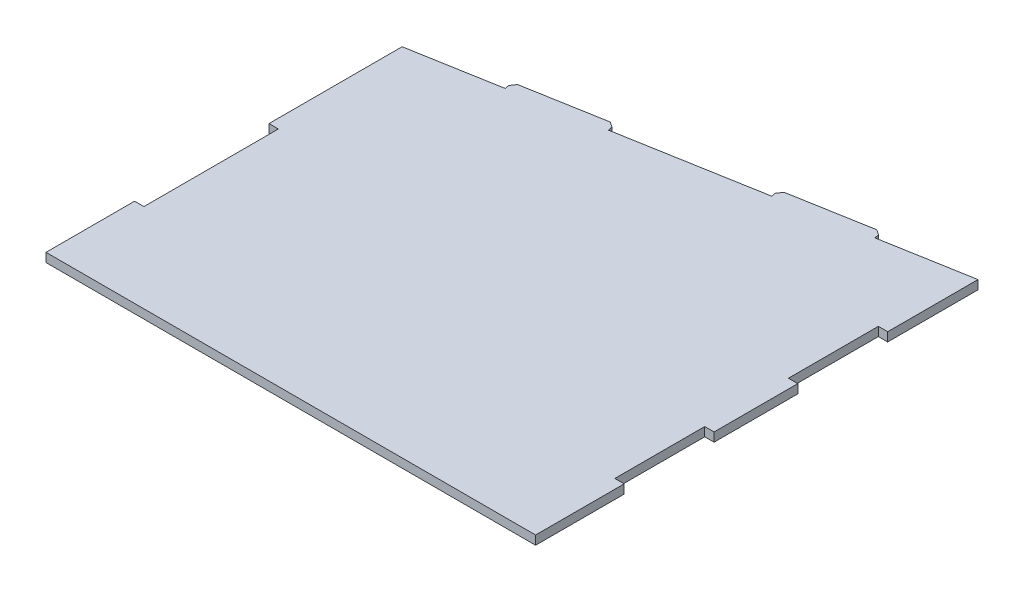
ISO-10303-21;
HEADER;
FILE_DESCRIPTION(('STEP AP214'),'2;1');
FILE_NAME('part.step','',(''),(''),'','','');
FILE_SCHEMA(('AUTOMOTIVE_DESIGN { 1 0 10303 214 1 1 1 1 }'));
ENDSEC;
DATA;
#1=APPLICATION_CONTEXT('core data for automotive mechanical design processes');
#2=APPLICATION_PROTOCOL_DEFINITION('international standard','automotive_design',2000,#1);
#3=PRODUCT_CONTEXT('',#1,'mechanical');
#4=PRODUCT('Part','Part','',(#3));
#5=PRODUCT_RELATED_PRODUCT_CATEGORY('part','',(#4));
#6=PRODUCT_DEFINITION_FORMATION('','',#4);
#7=PRODUCT_DEFINITION_CONTEXT('part definition',#1,'design');
#8=PRODUCT_DEFINITION('design','',#6,#7);
#9=PRODUCT_DEFINITION_SHAPE('','',#8);
#10=(LENGTH_UNIT() NAMED_UNIT(*) SI_UNIT(.MILLI.,.METRE.));
#11=(NAMED_UNIT(*) PLANE_ANGLE_UNIT() SI_UNIT($,.RADIAN.));
#12=(NAMED_UNIT(*) SI_UNIT($,.STERADIAN.) SOLID_ANGLE_UNIT());
#13=UNCERTAINTY_MEASURE_WITH_UNIT(LENGTH_MEASURE(1.E-05),#10,'distance_accuracy_value','');
#14=(GEOMETRIC_REPRESENTATION_CONTEXT(3) GLOBAL_UNCERTAINTY_ASSIGNED_CONTEXT((#13)) GLOBAL_UNIT_ASSIGNED_CONTEXT((#10,
#11,#12)) REPRESENTATION_CONTEXT('',''));
#15=CARTESIAN_POINT('',(0.,0.,0.));
#16=DIRECTION('',(0.,0.,1.));
#17=DIRECTION('',(1.,0.,0.));
#18=AXIS2_PLACEMENT_3D('',#15,#16,#17);
#19=CARTESIAN_POINT('',(-55.,-2.,9.69798393896559));
#20=DIRECTION('',(-0.173648177666931,0.,-0.984807753012208));
#21=DIRECTION('',(-0.984807753012208,0.,0.173648177666931));
#22=AXIS2_PLACEMENT_3D('',#19,#20,#21);
#23=PLANE('',#22);
#24=DIRECTION('',(-0.984807753012208,0.,0.173648177666931));
#25=VECTOR('',#24,1.);
#26=CARTESIAN_POINT('',(-55.,0.,9.69798393896559));
#27=LINE('',#26,#25);
#28=CARTESIAN_POINT('',(15.6076898795117,0.,-2.75205683228837));
#29=VERTEX_POINT('',#28);
#30=CARTESIAN_POINT('',(-15.6076898795117,0.,2.75205683228836));
#31=VERTEX_POINT('',#30);
#32=EDGE_CURVE('E91',#29,#31,#27,.T.);
#33=ORIENTED_EDGE('',*,*,#32,.F.);
#34=CARTESIAN_POINT('',(15.6076898795117,0.,-2.75205683228837));
#35=CARTESIAN_POINT('',(15.6076898795117,-2.,-2.75205683228837));
#36=B_SPLINE_CURVE_WITH_KNOTS('',1,(#34,#35),.UNSPECIFIED.,.F.,.F.,(2,2),(0.,
0.0454545454545455),.UNSPECIFIED.);
#37=CARTESIAN_POINT('',(15.6076898795117,-2.,-2.75205683228837));
#38=VERTEX_POINT('',#37);
#39=EDGE_CURVE('E258',#29,#38,#36,.T.);
#40=ORIENTED_EDGE('',*,*,#39,.T.);
#41=DIRECTION('',(-0.984807753012208,0.,0.173648177666931));
#42=VECTOR('',#41,1.);
#43=CARTESIAN_POINT('',(-55.,-2.,9.69798393896559));
#44=LINE('',#43,#42);
#45=CARTESIAN_POINT('',(-15.6076898795117,-2.,2.75205683228836));
#46=VERTEX_POINT('',#45);
#47=EDGE_CURVE('E269',#38,#46,#44,.T.);
#48=ORIENTED_EDGE('',*,*,#47,.T.);
#49=CARTESIAN_POINT('',(-15.6076898795117,-2.,2.75205683228836));
#50=CARTESIAN_POINT('',(-15.6076898795117,0.,2.75205683228836));
#51=B_SPLINE_CURVE_WITH_KNOTS('',1,(#49,#50),.UNSPECIFIED.,.F.,.F.,(2,2),(0.5,
0.545454545454545),.UNSPECIFIED.);
#52=EDGE_CURVE('E478',#46,#31,#51,.T.);
#53=ORIENTED_EDGE('',*,*,#52,.T.);
#54=EDGE_LOOP('',(#33,#40,#48,#53));
#55=FACE_BOUND('',#54,.T.);
#56=ADVANCED_FACE('F68',(#55),#23,.T.);
#57=CARTESIAN_POINT('',(55.,-2.,-9.6979839389656));
#58=VERTEX_POINT('',#57);
#59=CARTESIAN_POINT('',(35.3038449397558,-2.,-6.22502038562699));
#60=VERTEX_POINT('',#59);
#61=EDGE_CURVE('E277',#58,#60,#44,.T.);
#62=ORIENTED_EDGE('',*,*,#61,.T.);
#63=CARTESIAN_POINT('',(35.3038449397558,-2.,-6.22502038562699));
#64=CARTESIAN_POINT('',(35.3038449397558,0.,-6.22502038562699));
#65=B_SPLINE_CURVE_WITH_KNOTS('',1,(#63,#64),.UNSPECIFIED.,.F.,.F.,(2,2),(0.5,
0.545454545454545),.UNSPECIFIED.);
#66=CARTESIAN_POINT('',(35.3038449397558,0.,-6.22502038562698));
#67=VERTEX_POINT('',#66);
#68=EDGE_CURVE('E265',#60,#67,#65,.T.);
#69=ORIENTED_EDGE('',*,*,#68,.T.);
#70=CARTESIAN_POINT('',(55.,0.,-9.6979839389656));
#71=VERTEX_POINT('',#70);
#72=EDGE_CURVE('E299',#71,#67,#27,.T.);
#73=ORIENTED_EDGE('',*,*,#72,.F.);
#74=DIRECTION('',(0.,1.,0.));
#75=VECTOR('',#74,1.);
#76=CARTESIAN_POINT('',(55.,-2.,-9.6979839389656));
#77=LINE('',#76,#75);
#78=EDGE_CURVE('E292',#58,#71,#77,.T.);
#79=ORIENTED_EDGE('',*,*,#78,.F.);
#80=EDGE_LOOP('',(#62,#69,#73,#79));
#81=FACE_BOUND('',#80,.T.);
#82=ADVANCED_FACE('F553',(#81),#23,.T.);
#83=CARTESIAN_POINT('',(-35.3038449397558,0.,6.22502038562697));
#84=VERTEX_POINT('',#83);
#85=CARTESIAN_POINT('',(-55.,0.,9.69798393896559));
#86=VERTEX_POINT('',#85);
#87=EDGE_CURVE('E296',#84,#86,#27,.T.);
#88=ORIENTED_EDGE('',*,*,#87,.F.);
#89=CARTESIAN_POINT('',(-35.3038449397558,0.,6.22502038562697));
#90=CARTESIAN_POINT('',(-35.3038449397558,-2.,6.22502038562697));
#91=B_SPLINE_CURVE_WITH_KNOTS('',1,(#89,#90),.UNSPECIFIED.,.F.,.F.,(2,2),(0.,
0.0454545454545455),.UNSPECIFIED.);
#92=CARTESIAN_POINT('',(-35.3038449397558,-2.,6.22502038562697));
#93=VERTEX_POINT('',#92);
#94=EDGE_CURVE('E487',#84,#93,#91,.T.);
#95=ORIENTED_EDGE('',*,*,#94,.T.);
#96=CARTESIAN_POINT('',(-55.,-2.,9.69798393896559));
#97=VERTEX_POINT('',#96);
#98=EDGE_CURVE('E278',#93,#97,#44,.T.);
#99=ORIENTED_EDGE('',*,*,#98,.T.);
#100=DIRECTION('',(0.,1.,0.));
#101=VECTOR('',#100,1.);
#102=CARTESIAN_POINT('',(-55.,-2.,9.69798393896559));
#103=LINE('',#102,#101);
#104=EDGE_CURVE('E316',#97,#86,#103,.T.);
#105=ORIENTED_EDGE('',*,*,#104,.T.);
#106=EDGE_LOOP('',(#88,#95,#99,#105));
#107=FACE_BOUND('',#106,.T.);
#108=ADVANCED_FACE('F592',(#107),#23,.T.);
#109=CARTESIAN_POINT('',(55.,-2.,89.6979839389656));
#110=DIRECTION('',(1.,0.,0.));
#111=DIRECTION('',(0.,0.,-1.));
#112=AXIS2_PLACEMENT_3D('',#109,#110,#111);
#113=PLANE('',#112);
#114=DIRECTION('',(0.,0.,-1.));
#115=VECTOR('',#114,1.);
#116=CARTESIAN_POINT('',(55.,-2.,89.6979839389656));
#117=LINE('',#116,#115);
#118=CARTESIAN_POINT('',(55.,-2.,89.6979839389656));
#119=VERTEX_POINT('',#118);
#120=CARTESIAN_POINT('',(55.,-1.99999999999999,69.7979839389656));
#121=VERTEX_POINT('',#120);
#122=EDGE_CURVE('E282',#119,#121,#117,.T.);
#123=ORIENTED_EDGE('',*,*,#122,.T.);
#124=DIRECTION('',(0.,1.,0.));
#125=VECTOR('',#124,1.);
#126=CARTESIAN_POINT('',(55.,-2.,69.7979839389656));
#127=LINE('',#126,#125);
#128=CARTESIAN_POINT('',(55.,0.,69.7979839389656));
#129=VERTEX_POINT('',#128);
#130=EDGE_CURVE('E384',#121,#129,#127,.T.);
#131=ORIENTED_EDGE('',*,*,#130,.T.);
#132=DIRECTION('',(0.,0.,-1.));
#133=VECTOR('',#132,1.);
#134=CARTESIAN_POINT('',(55.,0.,89.6979839389656));
#135=LINE('',#134,#133);
#136=CARTESIAN_POINT('',(55.,0.,89.6979839389656));
#137=VERTEX_POINT('',#136);
#138=EDGE_CURVE('E293',#137,#129,#135,.T.);
#139=ORIENTED_EDGE('',*,*,#138,.F.);
#140=DIRECTION('',(0.,1.,0.));
#141=VECTOR('',#140,1.);
#142=CARTESIAN_POINT('',(55.,-2.,89.6979839389656));
#143=LINE('',#142,#141);
#144=EDGE_CURVE('E310',#119,#137,#143,.T.);
#145=ORIENTED_EDGE('',*,*,#144,.F.);
#146=EDGE_LOOP('',(#123,#131,#139,#145));
#147=FACE_BOUND('',#146,.T.);
#148=ADVANCED_FACE('F70',(#147),#113,.T.);
#149=CARTESIAN_POINT('',(55.,0.,49.5979839389656));
#150=VERTEX_POINT('',#149);
#151=CARTESIAN_POINT('',(55.,0.,30.7979839389656));
#152=VERTEX_POINT('',#151);
#153=EDGE_CURVE('E297',#150,#152,#135,.T.);
#154=ORIENTED_EDGE('',*,*,#153,.F.);
#155=DIRECTION('',(0.,-1.,0.));
#156=VECTOR('',#155,1.);
#157=CARTESIAN_POINT('',(55.,-2.,49.5979839389656));
#158=LINE('',#157,#156);
#159=CARTESIAN_POINT('',(55.,-1.99999999999999,49.5979839389656));
#160=VERTEX_POINT('',#159);
#161=EDGE_CURVE('E340',#150,#160,#158,.T.);
#162=ORIENTED_EDGE('',*,*,#161,.T.);
#163=CARTESIAN_POINT('',(55.,-1.99999999999999,30.7979839389656));
#164=VERTEX_POINT('',#163);
#165=EDGE_CURVE('E339',#160,#164,#117,.T.);
#166=ORIENTED_EDGE('',*,*,#165,.T.);
#167=DIRECTION('',(0.,1.,0.));
#168=VECTOR('',#167,1.);
#169=CARTESIAN_POINT('',(55.,-2.,30.7979839389656));
#170=LINE('',#169,#168);
#171=EDGE_CURVE('E328',#164,#152,#170,.T.);
#172=ORIENTED_EDGE('',*,*,#171,.T.);
#173=EDGE_LOOP('',(#154,#162,#166,#172));
#174=FACE_BOUND('',#173,.T.);
#175=ADVANCED_FACE('F336',(#174),#113,.T.);
#176=CARTESIAN_POINT('',(55.,0.,10.5979839389656));
#177=VERTEX_POINT('',#176);
#178=EDGE_CURVE('E298',#177,#71,#135,.T.);
#179=ORIENTED_EDGE('',*,*,#178,.F.);
#180=DIRECTION('',(0.,-1.,0.));
#181=VECTOR('',#180,1.);
#182=CARTESIAN_POINT('',(55.,-2.,10.5979839389656));
#183=LINE('',#182,#181);
#184=CARTESIAN_POINT('',(55.,-1.99999999999999,10.5979839389656));
#185=VERTEX_POINT('',#184);
#186=EDGE_CURVE('E341',#177,#185,#183,.T.);
#187=ORIENTED_EDGE('',*,*,#186,.T.);
#188=EDGE_CURVE('E309',#185,#58,#117,.T.);
#189=ORIENTED_EDGE('',*,*,#188,.T.);
#190=ORIENTED_EDGE('',*,*,#78,.T.);
#191=EDGE_LOOP('',(#179,#187,#189,#190));
#192=FACE_BOUND('',#191,.T.);
#193=ADVANCED_FACE('F630',(#192),#113,.T.);
#194=CARTESIAN_POINT('',(0.,-2.,0.));
#195=DIRECTION('',(0.,-1.,0.));
#196=DIRECTION('',(0.,0.,-1.));
#197=AXIS2_PLACEMENT_3D('',#194,#195,#196);
#198=PLANE('',#197);
#199=CARTESIAN_POINT('',(52.9,-1.99999999999999,49.5979839389656));
#200=CARTESIAN_POINT('',(52.9,-1.99999999999999,69.7979839389656));
#201=B_SPLINE_CURVE_WITH_KNOTS('',1,(#199,#200),.UNSPECIFIED.,.F.,.F.,(2,2),(0.0491071428571429,
0.5),.UNSPECIFIED.);
#202=CARTESIAN_POINT('',(52.9,-1.99999999999999,49.5979839389656));
#203=VERTEX_POINT('',#202);
#204=CARTESIAN_POINT('',(52.9,-1.99999999999999,69.7979839389656));
#205=VERTEX_POINT('',#204);
#206=EDGE_CURVE('E436',#203,#205,#201,.T.);
#207=ORIENTED_EDGE('',*,*,#206,.T.);
#208=CARTESIAN_POINT('',(52.9,-1.99999999999999,69.7979839389656));
#209=CARTESIAN_POINT('',(55.1,-1.99999999999999,69.7979839389656));
#210=B_SPLINE_CURVE_WITH_KNOTS('',1,(#208,#209),.UNSPECIFIED.,.F.,.F.,(2,2),(0.5,
0.549107142857143),.UNSPECIFIED.);
#211=EDGE_CURVE('E431',#205,#121,#210,.T.);
#212=ORIENTED_EDGE('',*,*,#211,.T.);
#213=ORIENTED_EDGE('',*,*,#122,.F.);
#214=DIRECTION('',(1.,0.,0.));
#215=VECTOR('',#214,1.);
#216=CARTESIAN_POINT('',(-55.,-2.,89.6979839389656));
#217=LINE('',#216,#215);
#218=CARTESIAN_POINT('',(-55.,-2.,89.6979839389656));
#219=VERTEX_POINT('',#218);
#220=EDGE_CURVE('E289',#219,#119,#217,.T.);
#221=ORIENTED_EDGE('',*,*,#220,.F.);
#222=DIRECTION('',(0.,0.,1.));
#223=VECTOR('',#222,1.);
#224=CARTESIAN_POINT('',(-55.,-2.,89.6979839389656));
#225=LINE('',#224,#223);
#226=CARTESIAN_POINT('',(-55.,-2.00000000000004,69.7979839389653));
#227=VERTEX_POINT('',#226);
#228=EDGE_CURVE('E281',#227,#219,#225,.T.);
#229=ORIENTED_EDGE('',*,*,#228,.F.);
#230=CARTESIAN_POINT('',(-52.8999999999998,-2.00000000000004,69.7979839389653));
#231=CARTESIAN_POINT('',(-55.0999999999998,-2.00000000000004,69.7979839389653));
#232=B_SPLINE_CURVE_WITH_KNOTS('',1,(#230,#231),.UNSPECIFIED.,.F.,.F.,(2,2),(0.5,
0.533950617283951),.UNSPECIFIED.);
#233=CARTESIAN_POINT('',(-52.8999999999998,-2.00000000000004,69.7979839389653));
#234=VERTEX_POINT('',#233);
#235=EDGE_CURVE('E364',#234,#227,#232,.T.);
#236=ORIENTED_EDGE('',*,*,#235,.F.);
#237=CARTESIAN_POINT('',(-52.8999999999997,-2.00000000000003,39.5979839389653));
#238=CARTESIAN_POINT('',(-52.8999999999998,-2.00000000000004,69.7979839389653));
#239=B_SPLINE_CURVE_WITH_KNOTS('',1,(#237,#238),.UNSPECIFIED.,.F.,.F.,(2,2),(0.0339506172839506,
0.5),.UNSPECIFIED.);
#240=CARTESIAN_POINT('',(-52.8999999999997,-2.00000000000003,39.5979839389653));
#241=VERTEX_POINT('',#240);
#242=EDGE_CURVE('E369',#241,#234,#239,.T.);
#243=ORIENTED_EDGE('',*,*,#242,.F.);
#244=CARTESIAN_POINT('',(-55.0999999999997,-2.00000000000003,39.5979839389653));
#245=CARTESIAN_POINT('',(-52.8999999999997,-2.00000000000003,39.5979839389653));
#246=B_SPLINE_CURVE_WITH_KNOTS('',1,(#244,#245),.UNSPECIFIED.,.F.,.F.,(2,2),(0.,
0.0339506172839506),.UNSPECIFIED.);
#247=CARTESIAN_POINT('',(-55.,-2.00000000000003,39.5979839389653));
#248=VERTEX_POINT('',#247);
#249=EDGE_CURVE('E377',#248,#241,#246,.T.);
#250=ORIENTED_EDGE('',*,*,#249,.F.);
#251=EDGE_CURVE('E286',#97,#248,#225,.T.);
#252=ORIENTED_EDGE('',*,*,#251,.F.);
#253=ORIENTED_EDGE('',*,*,#98,.F.);
#254=DIRECTION('',(0.173648177666931,0.,0.984807753012208));
#255=VECTOR('',#254,1.);
#256=CARTESIAN_POINT('',(-35.9984376504235,-2.,2.28578937357821));
#257=LINE('',#256,#255);
#258=CARTESIAN_POINT('',(-35.4774931174228,-2.,5.24021263261482));
#259=VERTEX_POINT('',#258);
#260=EDGE_CURVE('E476',#259,#93,#257,.T.);
#261=ORIENTED_EDGE('',*,*,#260,.F.);
#262=DIRECTION('',(0.573576436351044,0.,-0.819152044288994));
#263=VECTOR('',#262,1.);
#264=CARTESIAN_POINT('',(-34.2607537544048,-2.,3.50252873659611));
#265=LINE('',#264,#263);
#266=CARTESIAN_POINT('',(-34.6663335420775,-2.,4.08175670193568));
#267=VERTEX_POINT('',#266);
#268=EDGE_CURVE('E464',#259,#267,#265,.T.);
#269=ORIENTED_EDGE('',*,*,#268,.T.);
#270=DIRECTION('',(-0.984807753012208,0.,0.173648177666931));
#271=VECTOR('',#270,1.);
#272=CARTESIAN_POINT('',(-35.6511412950897,-2.,4.25540487960261));
#273=LINE('',#272,#271);
#274=CARTESIAN_POINT('',(-16.9397939878577,-2.,0.956089503930917));
#275=VERTEX_POINT('',#274);
#276=EDGE_CURVE('E472',#275,#267,#273,.T.);
#277=ORIENTED_EDGE('',*,*,#276,.F.);
#278=DIRECTION('',(0.819152044288993,0.,0.573576436351045));
#279=VECTOR('',#278,1.);
#280=CARTESIAN_POINT('',(-29.1035812599887,-2.,-7.56108603719447));
#281=LINE('',#280,#279);
#282=CARTESIAN_POINT('',(-15.7813380571786,-2.,1.76724907927619));
#283=VERTEX_POINT('',#282);
#284=EDGE_CURVE('E462',#275,#283,#281,.T.);
#285=ORIENTED_EDGE('',*,*,#284,.T.);
#286=DIRECTION('',(0.173648177666931,0.,0.984807753012208));
#287=VECTOR('',#286,1.);
#288=CARTESIAN_POINT('',(-16.3022825901794,-2.,-1.1871741797604));
#289=LINE('',#288,#287);
#290=EDGE_CURVE('E275',#283,#46,#289,.T.);
#291=ORIENTED_EDGE('',*,*,#290,.T.);
#292=ORIENTED_EDGE('',*,*,#47,.F.);
#293=DIRECTION('',(0.173648177666931,0.,0.984807753012208));
#294=VECTOR('',#293,1.);
#295=CARTESIAN_POINT('',(14.913097168844,-2.,-6.69128784433718));
#296=LINE('',#295,#294);
#297=CARTESIAN_POINT('',(15.4340417018448,-2.,-3.73686458530055));
#298=VERTEX_POINT('',#297);
#299=EDGE_CURVE('E254',#298,#38,#296,.T.);
#300=ORIENTED_EDGE('',*,*,#299,.F.);
#301=DIRECTION('',(0.573576436351044,0.,-0.819152044288993));
#302=VECTOR('',#301,1.);
#303=CARTESIAN_POINT('',(16.6507810648627,-2.,-5.47454848131927));
#304=LINE('',#303,#302);
#305=CARTESIAN_POINT('',(16.24520127719,-2.,-4.89532051597969));
#306=VERTEX_POINT('',#305);
#307=EDGE_CURVE('E509',#298,#306,#304,.T.);
#308=ORIENTED_EDGE('',*,*,#307,.T.);
#309=DIRECTION('',(-0.984807753012208,0.,0.173648177666931));
#310=VECTOR('',#309,1.);
#311=CARTESIAN_POINT('',(15.2603935241778,-2.,-4.72167233831276));
#312=LINE('',#311,#310);
#313=CARTESIAN_POINT('',(33.9717408314098,-2.,-8.02098771398445));
#314=VERTEX_POINT('',#313);
#315=EDGE_CURVE('E517',#314,#306,#312,.T.);
#316=ORIENTED_EDGE('',*,*,#315,.F.);
#317=DIRECTION('',(0.819152044288991,0.,0.573576436351048));
#318=VECTOR('',#317,1.);
#319=CARTESIAN_POINT('',(21.8079535592789,-2.,-16.5381632551099));
#320=LINE('',#319,#318);
#321=CARTESIAN_POINT('',(35.1301967620889,-2.,-7.20982813863917));
#322=VERTEX_POINT('',#321);
#323=EDGE_CURVE('E507',#314,#322,#320,.T.);
#324=ORIENTED_EDGE('',*,*,#323,.T.);
#325=DIRECTION('',(0.173648177666931,0.,0.984807753012208));
#326=VECTOR('',#325,1.);
#327=CARTESIAN_POINT('',(34.6092522290881,-2.,-10.1642513976758));
#328=LINE('',#327,#326);
#329=EDGE_CURVE('E264',#322,#60,#328,.T.);
#330=ORIENTED_EDGE('',*,*,#329,.T.);
#331=ORIENTED_EDGE('',*,*,#61,.F.);
#332=ORIENTED_EDGE('',*,*,#188,.F.);
#333=CARTESIAN_POINT('',(55.1,-1.99999999999999,10.5979839389656));
#334=CARTESIAN_POINT('',(52.9,-1.99999999999999,10.5979839389656));
#335=B_SPLINE_CURVE_WITH_KNOTS('',1,(#333,#334),.UNSPECIFIED.,.F.,.F.,(2,2),(0.,
0.0491071428571429),.UNSPECIFIED.);
#336=CARTESIAN_POINT('',(52.9,-1.99999999999999,10.5979839389656));
#337=VERTEX_POINT('',#336);
#338=EDGE_CURVE('E410',#185,#337,#335,.T.);
#339=ORIENTED_EDGE('',*,*,#338,.T.);
#340=CARTESIAN_POINT('',(52.9,-1.99999999999999,10.5979839389656));
#341=CARTESIAN_POINT('',(52.9,-1.99999999999999,30.7979839389656));
#342=B_SPLINE_CURVE_WITH_KNOTS('',1,(#340,#341),.UNSPECIFIED.,.F.,.F.,(2,2),(0.0491071428571429,
0.5),.UNSPECIFIED.);
#343=CARTESIAN_POINT('',(52.9,-1.99999999999999,30.7979839389656));
#344=VERTEX_POINT('',#343);
#345=EDGE_CURVE('E402',#337,#344,#342,.T.);
#346=ORIENTED_EDGE('',*,*,#345,.T.);
#347=CARTESIAN_POINT('',(52.9,-1.99999999999999,30.7979839389656));
#348=CARTESIAN_POINT('',(55.1,-1.99999999999999,30.7979839389656));
#349=B_SPLINE_CURVE_WITH_KNOTS('',1,(#347,#348),.UNSPECIFIED.,.F.,.F.,(2,2),(0.5,
0.549107142857143),.UNSPECIFIED.);
#350=EDGE_CURVE('E398',#344,#164,#349,.T.);
#351=ORIENTED_EDGE('',*,*,#350,.T.);
#352=ORIENTED_EDGE('',*,*,#165,.F.);
#353=CARTESIAN_POINT('',(55.1,-1.99999999999999,49.5979839389656));
#354=CARTESIAN_POINT('',(52.9,-1.99999999999999,49.5979839389656));
#355=B_SPLINE_CURVE_WITH_KNOTS('',1,(#353,#354),.UNSPECIFIED.,.F.,.F.,(2,2),(0.,
0.0491071428571429),.UNSPECIFIED.);
#356=EDGE_CURVE('E424',#160,#203,#355,.T.);
#357=ORIENTED_EDGE('',*,*,#356,.T.);
#358=EDGE_LOOP('',(#207,#212,#213,#221,#229,#236,#243,#250,#252,#253,#261,#269,#277,#285,#291,
#292,#300,#308,#316,#324,#330,#331,#332,#339,#346,#351,#352,#357));
#359=FACE_BOUND('',#358,.T.);
#360=ADVANCED_FACE('F273',(#359),#198,.T.);
#361=CARTESIAN_POINT('',(0.,0.,0.));
#362=DIRECTION('',(0.,-1.,0.));
#363=DIRECTION('',(0.,0.,-1.));
#364=AXIS2_PLACEMENT_3D('',#361,#362,#363);
#365=PLANE('',#364);
#366=DIRECTION('',(1.,0.,0.));
#367=VECTOR('',#366,1.);
#368=CARTESIAN_POINT('',(0.,0.,69.7979839389656));
#369=LINE('',#368,#367);
#370=CARTESIAN_POINT('',(52.9,0.,69.7979839389656));
#371=VERTEX_POINT('',#370);
#372=EDGE_CURVE('E13',#371,#129,#369,.T.);
#373=ORIENTED_EDGE('',*,*,#372,.F.);
#374=DIRECTION('',(0.,0.,-1.));
#375=VECTOR('',#374,1.);
#376=CARTESIAN_POINT('',(52.9,0.,49.5979839389656));
#377=LINE('',#376,#375);
#378=CARTESIAN_POINT('',(52.9,0.,49.5979839389656));
#379=VERTEX_POINT('',#378);
#380=EDGE_CURVE('E428',#371,#379,#377,.T.);
#381=ORIENTED_EDGE('',*,*,#380,.T.);
#382=DIRECTION('',(1.,0.,0.));
#383=VECTOR('',#382,1.);
#384=CARTESIAN_POINT('',(55.1,0.,49.5979839389656));
#385=LINE('',#384,#383);
#386=EDGE_CURVE('E347',#379,#150,#385,.T.);
#387=ORIENTED_EDGE('',*,*,#386,.T.);
#388=ORIENTED_EDGE('',*,*,#153,.T.);
#389=DIRECTION('',(1.,0.,0.));
#390=VECTOR('',#389,1.);
#391=CARTESIAN_POINT('',(0.,0.,30.7979839389656));
#392=LINE('',#391,#390);
#393=CARTESIAN_POINT('',(52.9,0.,30.7979839389656));
#394=VERTEX_POINT('',#393);
#395=EDGE_CURVE('E76',#394,#152,#392,.T.);
#396=ORIENTED_EDGE('',*,*,#395,.F.);
#397=DIRECTION('',(0.,0.,-1.));
#398=VECTOR('',#397,1.);
#399=CARTESIAN_POINT('',(52.9,0.,10.5979839389656));
#400=LINE('',#399,#398);
#401=CARTESIAN_POINT('',(52.9,0.,10.5979839389656));
#402=VERTEX_POINT('',#401);
#403=EDGE_CURVE('E396',#394,#402,#400,.T.);
#404=ORIENTED_EDGE('',*,*,#403,.T.);
#405=DIRECTION('',(1.,0.,0.));
#406=VECTOR('',#405,1.);
#407=CARTESIAN_POINT('',(55.1,0.,10.5979839389656));
#408=LINE('',#407,#406);
#409=EDGE_CURVE('E419',#402,#177,#408,.T.);
#410=ORIENTED_EDGE('',*,*,#409,.T.);
#411=ORIENTED_EDGE('',*,*,#178,.T.);
#412=ORIENTED_EDGE('',*,*,#72,.T.);
#413=DIRECTION('',(0.173648177666931,0.,0.984807753012208));
#414=VECTOR('',#413,1.);
#415=CARTESIAN_POINT('',(34.6092522290881,0.,-10.1642513976758));
#416=LINE('',#415,#414);
#417=CARTESIAN_POINT('',(35.1301967620889,0.,-7.20982813863917));
#418=VERTEX_POINT('',#417);
#419=EDGE_CURVE('E83',#418,#67,#416,.T.);
#420=ORIENTED_EDGE('',*,*,#419,.F.);
#421=DIRECTION('',(-0.819152044288991,0.,-0.573576436351048));
#422=VECTOR('',#421,1.);
#423=CARTESIAN_POINT('',(33.3925128660702,0.,-8.42656750165709));
#424=LINE('',#423,#422);
#425=CARTESIAN_POINT('',(33.9717408314098,0.,-8.02098771398445));
#426=VERTEX_POINT('',#425);
#427=EDGE_CURVE('E501',#418,#426,#424,.T.);
#428=ORIENTED_EDGE('',*,*,#427,.T.);
#429=DIRECTION('',(0.984807753012208,0.,-0.173648177666931));
#430=VECTOR('',#429,1.);
#431=CARTESIAN_POINT('',(34.956548584422,0.,-8.19463589165138));
#432=LINE('',#431,#430);
#433=CARTESIAN_POINT('',(16.24520127719,0.,-4.89532051597969));
#434=VERTEX_POINT('',#433);
#435=EDGE_CURVE('E519',#434,#426,#432,.T.);
#436=ORIENTED_EDGE('',*,*,#435,.F.);
#437=DIRECTION('',(-0.573576436351044,0.,0.819152044288993));
#438=VECTOR('',#437,1.);
#439=CARTESIAN_POINT('',(24.7623768183154,0.,-17.0591077881106));
#440=LINE('',#439,#438);
#441=CARTESIAN_POINT('',(15.4340417018448,0.,-3.73686458530055));
#442=VERTEX_POINT('',#441);
#443=EDGE_CURVE('E503',#434,#442,#440,.T.);
#444=ORIENTED_EDGE('',*,*,#443,.T.);
#445=DIRECTION('',(0.173648177666931,0.,0.984807753012208));
#446=VECTOR('',#445,1.);
#447=CARTESIAN_POINT('',(14.913097168844,0.,-6.69128784433718));
#448=LINE('',#447,#446);
#449=EDGE_CURVE('E523',#442,#29,#448,.T.);
#450=ORIENTED_EDGE('',*,*,#449,.T.);
#451=ORIENTED_EDGE('',*,*,#32,.T.);
#452=DIRECTION('',(0.173648177666931,0.,0.984807753012208));
#453=VECTOR('',#452,1.);
#454=CARTESIAN_POINT('',(-16.3022825901794,0.,-1.1871741797604));
#455=LINE('',#454,#453);
#456=CARTESIAN_POINT('',(-15.7813380571786,0.,1.76724907927619));
#457=VERTEX_POINT('',#456);
#458=EDGE_CURVE('E480',#457,#31,#455,.T.);
#459=ORIENTED_EDGE('',*,*,#458,.F.);
#460=DIRECTION('',(-0.819152044288993,0.,-0.573576436351045));
#461=VECTOR('',#460,1.);
#462=CARTESIAN_POINT('',(-17.5190219531973,0.,0.550509716258293));
#463=LINE('',#462,#461);
#464=CARTESIAN_POINT('',(-16.9397939878577,0.,0.956089503930918));
#465=VERTEX_POINT('',#464);
#466=EDGE_CURVE('E456',#457,#465,#463,.T.);
#467=ORIENTED_EDGE('',*,*,#466,.T.);
#468=DIRECTION('',(0.984807753012208,0.,-0.173648177666931));
#469=VECTOR('',#468,1.);
#470=CARTESIAN_POINT('',(-15.9549862348455,0.,0.782441326263986));
#471=LINE('',#470,#469);
#472=CARTESIAN_POINT('',(-34.6663335420775,0.,4.08175670193568));
#473=VERTEX_POINT('',#472);
#474=EDGE_CURVE('E475',#473,#465,#471,.T.);
#475=ORIENTED_EDGE('',*,*,#474,.F.);
#476=DIRECTION('',(-0.573576436351044,0.,0.819152044288994));
#477=VECTOR('',#476,1.);
#478=CARTESIAN_POINT('',(-26.1491580009521,0.,-8.08203057019526));
#479=LINE('',#478,#477);
#480=CARTESIAN_POINT('',(-35.4774931174228,0.,5.24021263261482));
#481=VERTEX_POINT('',#480);
#482=EDGE_CURVE('E458',#473,#481,#479,.T.);
#483=ORIENTED_EDGE('',*,*,#482,.T.);
#484=DIRECTION('',(0.173648177666931,0.,0.984807753012208));
#485=VECTOR('',#484,1.);
#486=CARTESIAN_POINT('',(-35.9984376504235,0.,2.28578937357821));
#487=LINE('',#486,#485);
#488=EDGE_CURVE('E482',#481,#84,#487,.T.);
#489=ORIENTED_EDGE('',*,*,#488,.T.);
#490=ORIENTED_EDGE('',*,*,#87,.T.);
#491=DIRECTION('',(0.,0.,1.));
#492=VECTOR('',#491,1.);
#493=CARTESIAN_POINT('',(-55.,0.,89.6979839389656));
#494=LINE('',#493,#492);
#495=CARTESIAN_POINT('',(-55.,0.,39.5979839389653));
#496=VERTEX_POINT('',#495);
#497=EDGE_CURVE('E303',#86,#496,#494,.T.);
#498=ORIENTED_EDGE('',*,*,#497,.T.);
#499=DIRECTION('',(-1.,0.,0.));
#500=VECTOR('',#499,1.);
#501=CARTESIAN_POINT('',(-55.0999999999997,0.,39.5979839389653));
#502=LINE('',#501,#500);
#503=CARTESIAN_POINT('',(-52.8999999999997,0.,39.5979839389653));
#504=VERTEX_POINT('',#503);
#505=EDGE_CURVE('E359',#504,#496,#502,.T.);
#506=ORIENTED_EDGE('',*,*,#505,.F.);
#507=DIRECTION('',(0.,0.,-1.));
#508=VECTOR('',#507,1.);
#509=CARTESIAN_POINT('',(-52.8999999999997,0.,39.5979839389653));
#510=LINE('',#509,#508);
#511=CARTESIAN_POINT('',(-52.8999999999998,0.,69.7979839389653));
#512=VERTEX_POINT('',#511);
#513=EDGE_CURVE('E355',#512,#504,#510,.T.);
#514=ORIENTED_EDGE('',*,*,#513,.F.);
#515=DIRECTION('',(-1.,0.,0.));
#516=VECTOR('',#515,1.);
#517=CARTESIAN_POINT('',(-2.07047144261167E-13,0.,69.7979839389654));
#518=LINE('',#517,#516);
#519=CARTESIAN_POINT('',(-55.,0.,69.7979839389653));
#520=VERTEX_POINT('',#519);
#521=EDGE_CURVE('E312',#512,#520,#518,.T.);
#522=ORIENTED_EDGE('',*,*,#521,.T.);
#523=CARTESIAN_POINT('',(-55.,0.,89.6979839389656));
#524=VERTEX_POINT('',#523);
#525=EDGE_CURVE('E302',#520,#524,#494,.T.);
#526=ORIENTED_EDGE('',*,*,#525,.T.);
#527=DIRECTION('',(1.,0.,0.));
#528=VECTOR('',#527,1.);
#529=CARTESIAN_POINT('',(-55.,0.,89.6979839389656));
#530=LINE('',#529,#528);
#531=EDGE_CURVE('E306',#524,#137,#530,.T.);
#532=ORIENTED_EDGE('',*,*,#531,.T.);
#533=ORIENTED_EDGE('',*,*,#138,.T.);
#534=EDGE_LOOP('',(#373,#381,#387,#388,#396,#404,#410,#411,#412,#420,#428,#436,#444,#450,#451,
#459,#467,#475,#483,#489,#490,#498,#506,#514,#522,#526,#532,#533));
#535=FACE_BOUND('',#534,.T.);
#536=ADVANCED_FACE('F345',(#535),#365,.F.);
#537=CARTESIAN_POINT('',(-55.,-2.,89.6979839389656));
#538=DIRECTION('',(-1.,0.,0.));
#539=DIRECTION('',(0.,0.,1.));
#540=AXIS2_PLACEMENT_3D('',#537,#538,#539);
#541=PLANE('',#540);
#542=DIRECTION('',(0.,-1.,0.));
#543=VECTOR('',#542,1.);
#544=CARTESIAN_POINT('',(-55.,-1.99999999999999,39.5979839389653));
#545=LINE('',#544,#543);
#546=EDGE_CURVE('E348',#496,#248,#545,.T.);
#547=ORIENTED_EDGE('',*,*,#546,.F.);
#548=ORIENTED_EDGE('',*,*,#497,.F.);
#549=ORIENTED_EDGE('',*,*,#104,.F.);
#550=ORIENTED_EDGE('',*,*,#251,.T.);
#551=EDGE_LOOP('',(#547,#548,#549,#550));
#552=FACE_BOUND('',#551,.T.);
#553=ADVANCED_FACE('F586',(#552),#541,.T.);
#554=CARTESIAN_POINT('',(-55.,-2.,89.6979839389656));
#555=DIRECTION('',(0.,0.,1.));
#556=DIRECTION('',(1.,0.,0.));
#557=AXIS2_PLACEMENT_3D('',#554,#555,#556);
#558=PLANE('',#557);
#559=ORIENTED_EDGE('',*,*,#531,.F.);
#560=DIRECTION('',(0.,1.,0.));
#561=VECTOR('',#560,1.);
#562=CARTESIAN_POINT('',(-55.,-2.,89.6979839389656));
#563=LINE('',#562,#561);
#564=EDGE_CURVE('E313',#219,#524,#563,.T.);
#565=ORIENTED_EDGE('',*,*,#564,.F.);
#566=ORIENTED_EDGE('',*,*,#220,.T.);
#567=ORIENTED_EDGE('',*,*,#144,.T.);
#568=EDGE_LOOP('',(#559,#565,#566,#567));
#569=FACE_BOUND('',#568,.T.);
#570=ADVANCED_FACE('F566',(#569),#558,.T.);
#571=DIRECTION('',(0.,1.,0.));
#572=VECTOR('',#571,1.);
#573=CARTESIAN_POINT('',(-55.,-2.,69.7979839389653));
#574=LINE('',#573,#572);
#575=EDGE_CURVE('E351',#227,#520,#574,.T.);
#576=ORIENTED_EDGE('',*,*,#575,.F.);
#577=ORIENTED_EDGE('',*,*,#228,.T.);
#578=ORIENTED_EDGE('',*,*,#564,.T.);
#579=ORIENTED_EDGE('',*,*,#525,.F.);
#580=EDGE_LOOP('',(#576,#577,#578,#579));
#581=FACE_BOUND('',#580,.T.);
#582=ADVANCED_FACE('F570',(#581),#541,.T.);
#583=CARTESIAN_POINT('',(-55.0999999999997,2.00000000000011,39.5979839389653));
#584=DIRECTION('',(0.,0.,-1.));
#585=DIRECTION('',(0.,-1.,0.));
#586=AXIS2_PLACEMENT_3D('',#583,#584,#585);
#587=PLANE('',#586);
#588=ORIENTED_EDGE('',*,*,#546,.T.);
#589=ORIENTED_EDGE('',*,*,#249,.T.);
#590=DIRECTION('',(0.,-1.,0.));
#591=VECTOR('',#590,1.);
#592=CARTESIAN_POINT('',(-52.8999999999997,2.00000000000011,39.5979839389653));
#593=LINE('',#592,#591);
#594=EDGE_CURVE('E360',#504,#241,#593,.T.);
#595=ORIENTED_EDGE('',*,*,#594,.F.);
#596=ORIENTED_EDGE('',*,*,#505,.T.);
#597=EDGE_LOOP('',(#588,#589,#595,#596));
#598=FACE_BOUND('',#597,.T.);
#599=ADVANCED_FACE('F581',(#598),#587,.F.);
#600=CARTESIAN_POINT('',(-52.8999999999998,2.0000000000001,69.7979839389653));
#601=DIRECTION('',(0.,0.,1.));
#602=DIRECTION('',(0.,1.,0.));
#603=AXIS2_PLACEMENT_3D('',#600,#601,#602);
#604=PLANE('',#603);
#605=ORIENTED_EDGE('',*,*,#575,.T.);
#606=ORIENTED_EDGE('',*,*,#521,.F.);
#607=DIRECTION('',(0.,-1.,0.));
#608=VECTOR('',#607,1.);
#609=CARTESIAN_POINT('',(-52.8999999999998,2.0000000000001,69.7979839389653));
#610=LINE('',#609,#608);
#611=EDGE_CURVE('E363',#512,#234,#610,.T.);
#612=ORIENTED_EDGE('',*,*,#611,.T.);
#613=ORIENTED_EDGE('',*,*,#235,.T.);
#614=EDGE_LOOP('',(#605,#606,#612,#613));
#615=FACE_BOUND('',#614,.T.);
#616=ADVANCED_FACE('F574',(#615),#604,.F.);
#617=CARTESIAN_POINT('',(-52.8999999999997,2.00000000000011,39.5979839389653));
#618=DIRECTION('',(1.,0.,0.));
#619=DIRECTION('',(0.,-1.,0.));
#620=AXIS2_PLACEMENT_3D('',#617,#618,#619);
#621=PLANE('',#620);
#622=ORIENTED_EDGE('',*,*,#513,.T.);
#623=ORIENTED_EDGE('',*,*,#594,.T.);
#624=ORIENTED_EDGE('',*,*,#242,.T.);
#625=ORIENTED_EDGE('',*,*,#611,.F.);
#626=EDGE_LOOP('',(#622,#623,#624,#625));
#627=FACE_BOUND('',#626,.T.);
#628=ADVANCED_FACE('F578',(#627),#621,.F.);
#629=CARTESIAN_POINT('',(52.9,2.00000000000021,30.7979839389656));
#630=DIRECTION('',(0.,0.,-1.));
#631=DIRECTION('',(0.,-1.,0.));
#632=AXIS2_PLACEMENT_3D('',#629,#630,#631);
#633=PLANE('',#632);
#634=ORIENTED_EDGE('',*,*,#350,.F.);
#635=DIRECTION('',(0.,-1.,0.));
#636=VECTOR('',#635,1.);
#637=CARTESIAN_POINT('',(52.9,2.00000000000021,30.7979839389656));
#638=LINE('',#637,#636);
#639=EDGE_CURVE('E330',#394,#344,#638,.T.);
#640=ORIENTED_EDGE('',*,*,#639,.F.);
#641=ORIENTED_EDGE('',*,*,#395,.T.);
#642=ORIENTED_EDGE('',*,*,#171,.F.);
#643=EDGE_LOOP('',(#634,#640,#641,#642));
#644=FACE_BOUND('',#643,.T.);
#645=ADVANCED_FACE('F327',(#644),#633,.T.);
#646=CARTESIAN_POINT('',(52.9,2.00000000000021,10.5979839389656));
#647=DIRECTION('',(1.,0.,0.));
#648=DIRECTION('',(0.,0.,-1.));
#649=AXIS2_PLACEMENT_3D('',#646,#647,#648);
#650=PLANE('',#649);
#651=ORIENTED_EDGE('',*,*,#639,.T.);
#652=ORIENTED_EDGE('',*,*,#345,.F.);
#653=DIRECTION('',(0.,-1.,0.));
#654=VECTOR('',#653,1.);
#655=CARTESIAN_POINT('',(52.9,2.00000000000021,10.5979839389656));
#656=LINE('',#655,#654);
#657=EDGE_CURVE('E394',#402,#337,#656,.T.);
#658=ORIENTED_EDGE('',*,*,#657,.F.);
#659=ORIENTED_EDGE('',*,*,#403,.F.);
#660=EDGE_LOOP('',(#651,#652,#658,#659));
#661=FACE_BOUND('',#660,.T.);
#662=ADVANCED_FACE('F643',(#661),#650,.T.);
#663=CARTESIAN_POINT('',(55.1,2.00000000000021,10.5979839389656));
#664=DIRECTION('',(0.,0.,1.));
#665=DIRECTION('',(0.,1.,0.));
#666=AXIS2_PLACEMENT_3D('',#663,#664,#665);
#667=PLANE('',#666);
#668=ORIENTED_EDGE('',*,*,#409,.F.);
#669=ORIENTED_EDGE('',*,*,#657,.T.);
#670=ORIENTED_EDGE('',*,*,#338,.F.);
#671=ORIENTED_EDGE('',*,*,#186,.F.);
#672=EDGE_LOOP('',(#668,#669,#670,#671));
#673=FACE_BOUND('',#672,.T.);
#674=ADVANCED_FACE('F640',(#673),#667,.T.);
#675=CARTESIAN_POINT('',(52.9,2.00000000000021,69.7979839389656));
#676=DIRECTION('',(0.,0.,-1.));
#677=DIRECTION('',(0.,-1.,0.));
#678=AXIS2_PLACEMENT_3D('',#675,#676,#677);
#679=PLANE('',#678);
#680=ORIENTED_EDGE('',*,*,#211,.F.);
#681=DIRECTION('',(0.,-1.,0.));
#682=VECTOR('',#681,1.);
#683=CARTESIAN_POINT('',(52.9,2.00000000000021,69.7979839389656));
#684=LINE('',#683,#682);
#685=EDGE_CURVE('E429',#371,#205,#684,.T.);
#686=ORIENTED_EDGE('',*,*,#685,.F.);
#687=ORIENTED_EDGE('',*,*,#372,.T.);
#688=ORIENTED_EDGE('',*,*,#130,.F.);
#689=EDGE_LOOP('',(#680,#686,#687,#688));
#690=FACE_BOUND('',#689,.T.);
#691=ADVANCED_FACE('F652',(#690),#679,.T.);
#692=CARTESIAN_POINT('',(52.9,2.00000000000021,49.5979839389656));
#693=DIRECTION('',(1.,0.,0.));
#694=DIRECTION('',(0.,0.,-1.));
#695=AXIS2_PLACEMENT_3D('',#692,#693,#694);
#696=PLANE('',#695);
#697=ORIENTED_EDGE('',*,*,#685,.T.);
#698=ORIENTED_EDGE('',*,*,#206,.F.);
#699=DIRECTION('',(0.,-1.,0.));
#700=VECTOR('',#699,1.);
#701=CARTESIAN_POINT('',(52.9,2.00000000000021,49.5979839389656));
#702=LINE('',#701,#700);
#703=EDGE_CURVE('E426',#379,#203,#702,.T.);
#704=ORIENTED_EDGE('',*,*,#703,.F.);
#705=ORIENTED_EDGE('',*,*,#380,.F.);
#706=EDGE_LOOP('',(#697,#698,#704,#705));
#707=FACE_BOUND('',#706,.T.);
#708=ADVANCED_FACE('F649',(#707),#696,.T.);
#709=CARTESIAN_POINT('',(55.1,2.00000000000021,49.5979839389656));
#710=DIRECTION('',(0.,0.,1.));
#711=DIRECTION('',(0.,1.,0.));
#712=AXIS2_PLACEMENT_3D('',#709,#710,#711);
#713=PLANE('',#712);
#714=ORIENTED_EDGE('',*,*,#386,.F.);
#715=ORIENTED_EDGE('',*,*,#703,.T.);
#716=ORIENTED_EDGE('',*,*,#356,.F.);
#717=ORIENTED_EDGE('',*,*,#161,.F.);
#718=EDGE_LOOP('',(#714,#715,#716,#717));
#719=FACE_BOUND('',#718,.T.);
#720=ADVANCED_FACE('F619',(#719),#713,.T.);
#721=CARTESIAN_POINT('',(-35.9984376504235,0.,2.28578937357821));
#722=DIRECTION('',(-0.984807753012208,0.,0.173648177666931));
#723=DIRECTION('',(0.173648177666931,0.,0.984807753012208));
#724=AXIS2_PLACEMENT_3D('',#721,#722,#723);
#725=PLANE('',#724);
#726=ORIENTED_EDGE('',*,*,#488,.F.);
#727=DIRECTION('',(0.,-1.,0.));
#728=VECTOR('',#727,1.);
#729=CARTESIAN_POINT('',(-35.4774931174228,-2.,5.24021263261482));
#730=LINE('',#729,#728);
#731=EDGE_CURVE('E418',#481,#259,#730,.T.);
#732=ORIENTED_EDGE('',*,*,#731,.T.);
#733=ORIENTED_EDGE('',*,*,#260,.T.);
#734=ORIENTED_EDGE('',*,*,#94,.F.);
#735=EDGE_LOOP('',(#726,#732,#733,#734));
#736=FACE_BOUND('',#735,.T.);
#737=ADVANCED_FACE('F596',(#736),#725,.T.);
#738=CARTESIAN_POINT('',(-16.3022825901794,-2.,-1.1871741797604));
#739=DIRECTION('',(0.984807753012208,0.,-0.173648177666931));
#740=DIRECTION('',(-0.173648177666931,0.,-0.984807753012208));
#741=AXIS2_PLACEMENT_3D('',#738,#739,#740);
#742=PLANE('',#741);
#743=ORIENTED_EDGE('',*,*,#290,.F.);
#744=DIRECTION('',(0.,1.,0.));
#745=VECTOR('',#744,1.);
#746=CARTESIAN_POINT('',(-15.7813380571786,0.,1.7672490792762));
#747=LINE('',#746,#745);
#748=EDGE_CURVE('E460',#283,#457,#747,.T.);
#749=ORIENTED_EDGE('',*,*,#748,.T.);
#750=ORIENTED_EDGE('',*,*,#458,.T.);
#751=ORIENTED_EDGE('',*,*,#52,.F.);
#752=EDGE_LOOP('',(#743,#749,#750,#751));
#753=FACE_BOUND('',#752,.T.);
#754=ADVANCED_FACE('F611',(#753),#742,.T.);
#755=CARTESIAN_POINT('',(-0.102607422812623,-77.,-2.01276076670864));
#756=DIRECTION('',(0.173648177666931,0.,0.984807753012208));
#757=DIRECTION('',(0.984807753012208,0.,-0.173648177666931));
#758=AXIS2_PLACEMENT_3D('',#755,#756,#757);
#759=PLANE('',#758);
#760=ORIENTED_EDGE('',*,*,#474,.T.);
#761=DIRECTION('',(0.,-1.,0.));
#762=VECTOR('',#761,1.);
#763=CARTESIAN_POINT('',(-16.9397939878577,-2.,0.956089503930917));
#764=LINE('',#763,#762);
#765=EDGE_CURVE('E466',#465,#275,#764,.T.);
#766=ORIENTED_EDGE('',*,*,#765,.T.);
#767=ORIENTED_EDGE('',*,*,#276,.T.);
#768=DIRECTION('',(0.,1.,0.));
#769=VECTOR('',#768,1.);
#770=CARTESIAN_POINT('',(-34.6663335420775,0.,4.08175670193568));
#771=LINE('',#770,#769);
#772=EDGE_CURVE('E469',#267,#473,#771,.T.);
#773=ORIENTED_EDGE('',*,*,#772,.T.);
#774=EDGE_LOOP('',(#760,#766,#767,#773));
#775=FACE_BOUND('',#774,.T.);
#776=ADVANCED_FACE('F603',(#775),#759,.F.);
#777=CARTESIAN_POINT('',(-16.9397939878577,-77.,0.956089503930906));
#778=DIRECTION('',(0.573576436351045,0.,-0.819152044288993));
#779=DIRECTION('',(0.,1.,0.));
#780=AXIS2_PLACEMENT_3D('',#777,#778,#779);
#781=PLANE('',#780);
#782=ORIENTED_EDGE('',*,*,#466,.F.);
#783=ORIENTED_EDGE('',*,*,#748,.F.);
#784=ORIENTED_EDGE('',*,*,#284,.F.);
#785=ORIENTED_EDGE('',*,*,#765,.F.);
#786=EDGE_LOOP('',(#782,#783,#784,#785));
#787=FACE_BOUND('',#786,.T.);
#788=ADVANCED_FACE('F608',(#787),#781,.T.);
#789=CARTESIAN_POINT('',(-34.6663335420775,-77.,4.08175670193567));
#790=DIRECTION('',(-0.819152044288993,0.,-0.573576436351044));
#791=DIRECTION('',(0.,-1.,0.));
#792=AXIS2_PLACEMENT_3D('',#789,#790,#791);
#793=PLANE('',#792);
#794=ORIENTED_EDGE('',*,*,#268,.F.);
#795=ORIENTED_EDGE('',*,*,#731,.F.);
#796=ORIENTED_EDGE('',*,*,#482,.F.);
#797=ORIENTED_EDGE('',*,*,#772,.F.);
#798=EDGE_LOOP('',(#794,#795,#796,#797));
#799=FACE_BOUND('',#798,.T.);
#800=ADVANCED_FACE('F599',(#799),#793,.T.);
#801=CARTESIAN_POINT('',(14.913097168844,0.,-6.69128784433718));
#802=DIRECTION('',(-0.984807753012208,0.,0.173648177666931));
#803=DIRECTION('',(0.173648177666931,0.,0.984807753012208));
#804=AXIS2_PLACEMENT_3D('',#801,#802,#803);
#805=PLANE('',#804);
#806=ORIENTED_EDGE('',*,*,#449,.F.);
#807=DIRECTION('',(0.,-1.,0.));
#808=VECTOR('',#807,1.);
#809=CARTESIAN_POINT('',(15.4340417018448,-2.,-3.73686458530055));
#810=LINE('',#809,#808);
#811=EDGE_CURVE('E260',#442,#298,#810,.T.);
#812=ORIENTED_EDGE('',*,*,#811,.T.);
#813=ORIENTED_EDGE('',*,*,#299,.T.);
#814=ORIENTED_EDGE('',*,*,#39,.F.);
#815=EDGE_LOOP('',(#806,#812,#813,#814));
#816=FACE_BOUND('',#815,.T.);
#817=ADVANCED_FACE('F257',(#816),#805,.T.);
#818=CARTESIAN_POINT('',(34.6092522290881,-2.,-10.1642513976758));
#819=DIRECTION('',(0.984807753012208,0.,-0.173648177666931));
#820=DIRECTION('',(-0.173648177666931,0.,-0.984807753012208));
#821=AXIS2_PLACEMENT_3D('',#818,#819,#820);
#822=PLANE('',#821);
#823=ORIENTED_EDGE('',*,*,#329,.F.);
#824=DIRECTION('',(0.,1.,0.));
#825=VECTOR('',#824,1.);
#826=CARTESIAN_POINT('',(35.1301967620889,0.,-7.20982813863917));
#827=LINE('',#826,#825);
#828=EDGE_CURVE('E505',#322,#418,#827,.T.);
#829=ORIENTED_EDGE('',*,*,#828,.T.);
#830=ORIENTED_EDGE('',*,*,#419,.T.);
#831=ORIENTED_EDGE('',*,*,#68,.F.);
#832=EDGE_LOOP('',(#823,#829,#830,#831));
#833=FACE_BOUND('',#832,.T.);
#834=ADVANCED_FACE('F549',(#833),#822,.T.);
#835=CARTESIAN_POINT('',(-0.102607422812623,-77.,-2.01276076670864));
#836=DIRECTION('',(0.173648177666931,0.,0.984807753012208));
#837=DIRECTION('',(0.984807753012208,0.,-0.173648177666931));
#838=AXIS2_PLACEMENT_3D('',#835,#836,#837);
#839=PLANE('',#838);
#840=ORIENTED_EDGE('',*,*,#435,.T.);
#841=DIRECTION('',(0.,-1.,0.));
#842=VECTOR('',#841,1.);
#843=CARTESIAN_POINT('',(33.9717408314098,-2.,-8.02098771398445));
#844=LINE('',#843,#842);
#845=EDGE_CURVE('E511',#426,#314,#844,.T.);
#846=ORIENTED_EDGE('',*,*,#845,.T.);
#847=ORIENTED_EDGE('',*,*,#315,.T.);
#848=DIRECTION('',(0.,1.,0.));
#849=VECTOR('',#848,1.);
#850=CARTESIAN_POINT('',(16.24520127719,0.,-4.89532051597969));
#851=LINE('',#850,#849);
#852=EDGE_CURVE('E514',#306,#434,#851,.T.);
#853=ORIENTED_EDGE('',*,*,#852,.T.);
#854=EDGE_LOOP('',(#840,#846,#847,#853));
#855=FACE_BOUND('',#854,.T.);
#856=ADVANCED_FACE('F540',(#855),#839,.F.);
#857=CARTESIAN_POINT('',(33.9717408314098,-77.,-8.02098771398446));
#858=DIRECTION('',(0.573576436351048,0.,-0.819152044288991));
#859=DIRECTION('',(0.,1.,0.));
#860=AXIS2_PLACEMENT_3D('',#857,#858,#859);
#861=PLANE('',#860);
#862=ORIENTED_EDGE('',*,*,#427,.F.);
#863=ORIENTED_EDGE('',*,*,#828,.F.);
#864=ORIENTED_EDGE('',*,*,#323,.F.);
#865=ORIENTED_EDGE('',*,*,#845,.F.);
#866=EDGE_LOOP('',(#862,#863,#864,#865));
#867=FACE_BOUND('',#866,.T.);
#868=ADVANCED_FACE('F545',(#867),#861,.T.);
#869=CARTESIAN_POINT('',(16.24520127719,-77.,-4.8953205159797));
#870=DIRECTION('',(-0.819152044288993,0.,-0.573576436351044));
#871=DIRECTION('',(0.,-1.,0.));
#872=AXIS2_PLACEMENT_3D('',#869,#870,#871);
#873=PLANE('',#872);
#874=ORIENTED_EDGE('',*,*,#307,.F.);
#875=ORIENTED_EDGE('',*,*,#811,.F.);
#876=ORIENTED_EDGE('',*,*,#443,.F.);
#877=ORIENTED_EDGE('',*,*,#852,.F.);
#878=EDGE_LOOP('',(#874,#875,#876,#877));
#879=FACE_BOUND('',#878,.T.);
#880=ADVANCED_FACE('F839',(#879),#873,.T.);
#881=CLOSED_SHELL('',(#56,#82,#108,#148,#175,#193,#360,#536,#553,#570,#582,#599,#616,#628,#645,
#662,#674,#691,#708,#720,#737,#754,#776,#788,#800,#817,#834,#856,#868,#880));
#882=MANIFOLD_SOLID_BREP('B2',#881);
#883=ADVANCED_BREP_SHAPE_REPRESENTATION('',(#18,#882),#14);
#884=SHAPE_DEFINITION_REPRESENTATION(#9,#883);
ENDSEC;
END-ISO-10303-21;
